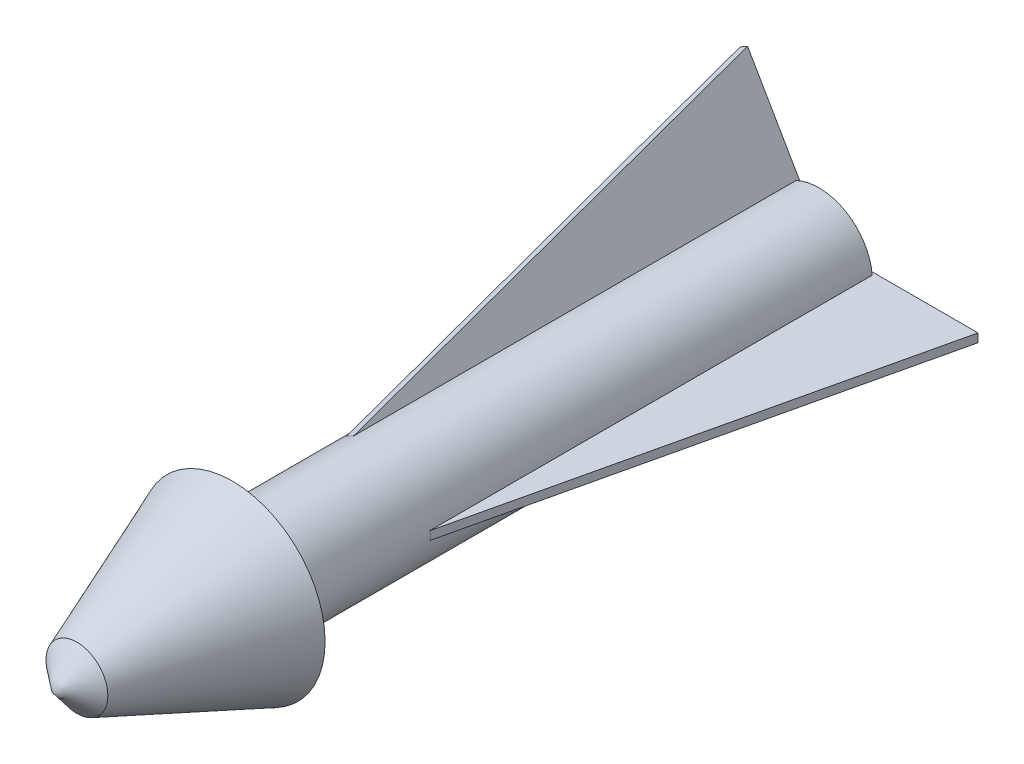
ISO-10303-21;
HEADER;
FILE_DESCRIPTION(('STEP AP214'),'2;1');
FILE_NAME('part.step','',(''),(''),'','','');
FILE_SCHEMA(('AUTOMOTIVE_DESIGN { 1 0 10303 214 1 1 1 1 }'));
ENDSEC;
DATA;
#1=APPLICATION_CONTEXT('core data for automotive mechanical design processes');
#2=APPLICATION_PROTOCOL_DEFINITION('international standard','automotive_design',2000,#1);
#3=PRODUCT_CONTEXT('',#1,'mechanical');
#4=PRODUCT('Part','Part','',(#3));
#5=PRODUCT_RELATED_PRODUCT_CATEGORY('part','',(#4));
#6=PRODUCT_DEFINITION_FORMATION('','',#4);
#7=PRODUCT_DEFINITION_CONTEXT('part definition',#1,'design');
#8=PRODUCT_DEFINITION('design','',#6,#7);
#9=PRODUCT_DEFINITION_SHAPE('','',#8);
#10=(LENGTH_UNIT() NAMED_UNIT(*) SI_UNIT(.MILLI.,.METRE.));
#11=(NAMED_UNIT(*) PLANE_ANGLE_UNIT() SI_UNIT($,.RADIAN.));
#12=(NAMED_UNIT(*) SI_UNIT($,.STERADIAN.) SOLID_ANGLE_UNIT());
#13=UNCERTAINTY_MEASURE_WITH_UNIT(LENGTH_MEASURE(1.E-05),#10,'distance_accuracy_value','');
#14=(GEOMETRIC_REPRESENTATION_CONTEXT(3) GLOBAL_UNCERTAINTY_ASSIGNED_CONTEXT((#13)) GLOBAL_UNIT_ASSIGNED_CONTEXT((#10,
#11,#12)) REPRESENTATION_CONTEXT('',''));
#15=CARTESIAN_POINT('',(0.,0.,0.));
#16=DIRECTION('',(0.,0.,1.));
#17=DIRECTION('',(1.,0.,0.));
#18=AXIS2_PLACEMENT_3D('',#15,#16,#17);
#19=CARTESIAN_POINT('',(0.,0.,11.9935273165166));
#20=DIRECTION('',(0.,0.,-1.));
#21=DIRECTION('',(-1.,0.,0.));
#22=AXIS2_PLACEMENT_3D('',#19,#20,#21);
#23=CONICAL_SURFACE('',#22,10.8765960729396,0.378160492061769);
#24=CARTESIAN_POINT('',(0.,0.,30.2386429629564));
#25=DIRECTION('',(0.,0.,1.));
#26=DIRECTION('',(1.,0.,0.));
#27=AXIS2_PLACEMENT_3D('',#24,#25,#26);
#28=CIRCLE('',#27,3.62815245560455);
#29=CARTESIAN_POINT('',(3.62815245560455,0.,30.2386429629564));
#30=VERTEX_POINT('',#29);
#31=EDGE_CURVE('E231',#30,#30,#28,.T.);
#32=ORIENTED_EDGE('',*,*,#31,.F.);
#33=EDGE_LOOP('',(#32));
#34=FACE_BOUND('',#33,.T.);
#35=CARTESIAN_POINT('',(0.,0.,11.9935273165166));
#36=DIRECTION('',(0.,0.,1.));
#37=DIRECTION('',(1.,0.,0.));
#38=AXIS2_PLACEMENT_3D('',#35,#36,#37);
#39=CIRCLE('',#38,10.8765960729396);
#40=CARTESIAN_POINT('',(10.8765960729396,0.,11.9935273165166));
#41=VERTEX_POINT('',#40);
#42=EDGE_CURVE('E244',#41,#41,#39,.T.);
#43=ORIENTED_EDGE('',*,*,#42,.T.);
#44=EDGE_LOOP('',(#43));
#45=FACE_BOUND('',#44,.T.);
#46=ADVANCED_FACE('F37',(#34,#45),#23,.T.);
#47=CARTESIAN_POINT('',(0.,6.26680222571906,11.9935273165166));
#48=DIRECTION('',(0.,0.,1.));
#49=DIRECTION('',(1.,0.,0.));
#50=AXIS2_PLACEMENT_3D('',#47,#48,#49);
#51=PLANE('',#50);
#52=CARTESIAN_POINT('',(0.,0.,11.9935273165166));
#53=DIRECTION('',(0.,0.,1.));
#54=DIRECTION('',(1.,0.,0.));
#55=AXIS2_PLACEMENT_3D('',#52,#53,#54);
#56=CIRCLE('',#55,9.26680222571906);
#57=CARTESIAN_POINT('',(9.26680222571906,0.,11.9935273165166));
#58=VERTEX_POINT('',#57);
#59=EDGE_CURVE('E248',#58,#58,#56,.T.);
#60=ORIENTED_EDGE('',*,*,#59,.T.);
#61=EDGE_LOOP('',(#60));
#62=FACE_BOUND('',#61,.T.);
#63=ORIENTED_EDGE('',*,*,#42,.F.);
#64=EDGE_LOOP('',(#63));
#65=FACE_BOUND('',#64,.T.);
#66=ADVANCED_FACE('F340',(#62,#65),#51,.F.);
#67=CARTESIAN_POINT('',(0.,0.,44.6785167901676));
#68=DIRECTION('',(0.,0.,1.));
#69=DIRECTION('',(1.,0.,0.));
#70=AXIS2_PLACEMENT_3D('',#67,#68,#69);
#71=CYLINDRICAL_SURFACE('',#70,6.26680222571906);
#72=CARTESIAN_POINT('',(0.,0.,8.99352731651661));
#73=DIRECTION('',(0.,0.,1.));
#74=DIRECTION('',(1.,0.,0.));
#75=AXIS2_PLACEMENT_3D('',#72,#73,#74);
#76=CIRCLE('',#75,6.26680222571906);
#77=CARTESIAN_POINT('',(6.26680222571906,0.,8.99352731651661));
#78=VERTEX_POINT('',#77);
#79=EDGE_CURVE('E251',#78,#78,#76,.F.);
#80=ORIENTED_EDGE('',*,*,#79,.T.);
#81=EDGE_LOOP('',(#80));
#82=FACE_BOUND('',#81,.T.);
#83=CARTESIAN_POINT('',(0.,0.,22.1517486672609));
#84=DIRECTION('',(0.487185032392611,0.843829228791109,-0.224951054343858));
#85=DIRECTION('',(0.112475527171927,0.194813327669876,0.974370064785237));
#86=AXIS2_PLACEMENT_3D('',#83,#84,#85);
#87=ELLIPSE('',#86,27.8585145733066,6.26680222571906);
#88=CARTESIAN_POINT('',(-2.69039930008079,-5.65990828038778,-4.90621879673166));
#89=VERTEX_POINT('',#88);
#90=CARTESIAN_POINT('',(-3.55642470386523,-5.15990828038779,-4.9062187967316));
#91=VERTEX_POINT('',#90);
#92=EDGE_CURVE('E11',#89,#91,#87,.T.);
#93=ORIENTED_EDGE('',*,*,#92,.F.);
#94=DIRECTION('',(0.,0.,1.));
#95=VECTOR('',#94,1.);
#96=CARTESIAN_POINT('',(-2.69039930008079,-5.65990828038778,44.6785167901676));
#97=LINE('',#96,#95);
#98=CARTESIAN_POINT('',(-2.69039930008079,-5.65990828038779,-56.8355676073596));
#99=VERTEX_POINT('',#98);
#100=EDGE_CURVE('E171',#89,#99,#97,.F.);
#101=ORIENTED_EDGE('',*,*,#100,.T.);
#102=CARTESIAN_POINT('',(0.,0.,-56.8355676073596));
#103=DIRECTION('',(0.,0.,1.));
#104=DIRECTION('',(1.,0.,0.));
#105=AXIS2_PLACEMENT_3D('',#102,#103,#104);
#106=CIRCLE('',#105,6.26680222571906);
#107=CARTESIAN_POINT('',(6.24682400394612,-0.5,-56.8355676073596));
#108=VERTEX_POINT('',#107);
#109=EDGE_CURVE('E240',#99,#108,#106,.T.);
#110=ORIENTED_EDGE('',*,*,#109,.T.);
#111=DIRECTION('',(0.,0.,1.));
#112=VECTOR('',#111,1.);
#113=CARTESIAN_POINT('',(6.24682400394611,-0.5,44.6785167901676));
#114=LINE('',#113,#112);
#115=CARTESIAN_POINT('',(6.24682400394611,-0.5,-4.9062187967316));
#116=VERTEX_POINT('',#115);
#117=EDGE_CURVE('E226',#116,#108,#114,.F.);
#118=ORIENTED_EDGE('',*,*,#117,.F.);
#119=CARTESIAN_POINT('',(0.,0.,22.1517486672609));
#120=DIRECTION('',(-0.974370064785237,0.,-0.224951054343858));
#121=DIRECTION('',(-0.224951054343858,0.,0.974370064785237));
#122=AXIS2_PLACEMENT_3D('',#119,#120,#121);
#123=ELLIPSE('',#122,27.8585145733066,6.26680222571906);
#124=CARTESIAN_POINT('',(6.24682400394612,0.5,-4.90621879673165));
#125=VERTEX_POINT('',#124);
#126=EDGE_CURVE('E262',#125,#116,#123,.T.);
#127=ORIENTED_EDGE('',*,*,#126,.F.);
#128=DIRECTION('',(0.,0.,1.));
#129=VECTOR('',#128,1.);
#130=CARTESIAN_POINT('',(6.24682400394611,0.5,44.6785167901676));
#131=LINE('',#130,#129);
#132=CARTESIAN_POINT('',(6.24682400394612,0.5,-56.8355676073596));
#133=VERTEX_POINT('',#132);
#134=EDGE_CURVE('E229',#125,#133,#131,.F.);
#135=ORIENTED_EDGE('',*,*,#134,.T.);
#136=CARTESIAN_POINT('',(-2.69039930008087,5.65990828038775,-56.8355676073596));
#137=VERTEX_POINT('',#136);
#138=EDGE_CURVE('E241',#133,#137,#106,.T.);
#139=ORIENTED_EDGE('',*,*,#138,.T.);
#140=DIRECTION('',(0.,0.,1.));
#141=VECTOR('',#140,1.);
#142=CARTESIAN_POINT('',(-2.69039930008086,5.65990828038775,44.6785167901676));
#143=LINE('',#142,#141);
#144=CARTESIAN_POINT('',(-2.69039930008086,5.65990828038774,-4.9062187967316));
#145=VERTEX_POINT('',#144);
#146=EDGE_CURVE('E199',#145,#137,#143,.F.);
#147=ORIENTED_EDGE('',*,*,#146,.F.);
#148=CARTESIAN_POINT('',(0.,0.,22.1517486672609));
#149=DIRECTION('',(0.487185032392622,-0.843829228791102,-0.224951054343858));
#150=DIRECTION('',(0.11247552717193,-0.194813327669875,0.974370064785237));
#151=AXIS2_PLACEMENT_3D('',#148,#149,#150);
#152=ELLIPSE('',#151,27.8585145733066,6.26680222571906);
#153=CARTESIAN_POINT('',(-3.5564247038653,5.15990828038774,-4.90621879673165));
#154=VERTEX_POINT('',#153);
#155=EDGE_CURVE('E273',#154,#145,#152,.T.);
#156=ORIENTED_EDGE('',*,*,#155,.F.);
#157=DIRECTION('',(0.,0.,1.));
#158=VECTOR('',#157,1.);
#159=CARTESIAN_POINT('',(-3.5564247038653,5.15990828038774,44.6785167901676));
#160=LINE('',#159,#158);
#161=CARTESIAN_POINT('',(-3.5564247038653,5.15990828038774,-56.8355676073596));
#162=VERTEX_POINT('',#161);
#163=EDGE_CURVE('E202',#154,#162,#160,.F.);
#164=ORIENTED_EDGE('',*,*,#163,.T.);
#165=CARTESIAN_POINT('',(-3.55642470386523,-5.1599082803878,-56.8355676073596));
#166=VERTEX_POINT('',#165);
#167=EDGE_CURVE('E245',#162,#166,#106,.T.);
#168=ORIENTED_EDGE('',*,*,#167,.T.);
#169=DIRECTION('',(0.,0.,1.));
#170=VECTOR('',#169,1.);
#171=CARTESIAN_POINT('',(-3.55642470386523,-5.15990828038779,44.6785167901676));
#172=LINE('',#171,#170);
#173=EDGE_CURVE('E55',#91,#166,#172,.F.);
#174=ORIENTED_EDGE('',*,*,#173,.F.);
#175=EDGE_LOOP('',(#93,#101,#110,#118,#127,#135,#139,#147,#156,#164,#168,#174));
#176=FACE_BOUND('',#175,.T.);
#177=ADVANCED_FACE('F295',(#82,#176),#71,.T.);
#178=CARTESIAN_POINT('',(0.,4.93302839592502,-56.8355676073596));
#179=DIRECTION('',(0.,0.,1.));
#180=DIRECTION('',(1.,0.,0.));
#181=AXIS2_PLACEMENT_3D('',#178,#179,#180);
#182=PLANE('',#181);
#183=ORIENTED_EDGE('',*,*,#109,.F.);
#184=DIRECTION('',(0.499999999999992,0.866025403784443,0.));
#185=VECTOR('',#184,1.);
#186=CARTESIAN_POINT('',(2.56907665612273,3.44977129694381,-56.8355676073596));
#187=LINE('',#186,#185);
#188=CARTESIAN_POINT('',(-2.35458275123341,-5.07825695576168,-56.8355676073596));
#189=VERTEX_POINT('',#188);
#190=EDGE_CURVE('E45',#99,#189,#187,.T.);
#191=ORIENTED_EDGE('',*,*,#190,.T.);
#192=DIRECTION('',(0.866025403784443,-0.499999999999992,0.));
#193=VECTOR('',#192,1.);
#194=CARTESIAN_POINT('',(-4.92365940735614,-3.59499985678047,-56.8355676073596));
#195=LINE('',#194,#193);
#196=CARTESIAN_POINT('',(-3.22060815501785,-4.57825695576168,-56.8355676073596));
#197=VERTEX_POINT('',#196);
#198=EDGE_CURVE('E152',#197,#189,#195,.T.);
#199=ORIENTED_EDGE('',*,*,#198,.F.);
#200=DIRECTION('',(0.499999999999992,0.866025403784443,0.));
#201=VECTOR('',#200,1.);
#202=CARTESIAN_POINT('',(1.70305125233829,3.9497712969438,-56.8355676073596));
#203=LINE('',#202,#201);
#204=EDGE_CURVE('E276',#166,#197,#203,.T.);
#205=ORIENTED_EDGE('',*,*,#204,.F.);
#206=ORIENTED_EDGE('',*,*,#167,.F.);
#207=DIRECTION('',(0.500000000000004,-0.866025403784436,0.));
#208=VECTOR('',#207,1.);
#209=CARTESIAN_POINT('',(-2.56907665612276,3.44977129694374,-56.8355676073596));
#210=LINE('',#209,#208);
#211=CARTESIAN_POINT('',(-3.22060815501792,4.57825695576164,-56.8355676073596));
#212=VERTEX_POINT('',#211);
#213=EDGE_CURVE('E271',#162,#212,#210,.T.);
#214=ORIENTED_EDGE('',*,*,#213,.T.);
#215=DIRECTION('',(-0.866025403784436,-0.500000000000004,0.));
#216=VECTOR('',#215,1.);
#217=CARTESIAN_POINT('',(-0.651531498895152,6.06151405474292,-56.8355676073596));
#218=LINE('',#217,#216);
#219=CARTESIAN_POINT('',(-2.35458275123348,5.07825695576164,-56.8355676073596));
#220=VERTEX_POINT('',#219);
#221=EDGE_CURVE('E268',#220,#212,#218,.T.);
#222=ORIENTED_EDGE('',*,*,#221,.F.);
#223=DIRECTION('',(0.500000000000004,-0.866025403784436,0.));
#224=VECTOR('',#223,1.);
#225=CARTESIAN_POINT('',(-1.70305125233833,3.94977129694375,-56.8355676073596));
#226=LINE('',#225,#224);
#227=EDGE_CURVE('E265',#137,#220,#226,.T.);
#228=ORIENTED_EDGE('',*,*,#227,.F.);
#229=ORIENTED_EDGE('',*,*,#138,.F.);
#230=DIRECTION('',(-1.,0.,0.));
#231=VECTOR('',#230,1.);
#232=CARTESIAN_POINT('',(0.,0.5,-56.8355676073596));
#233=LINE('',#232,#231);
#234=CARTESIAN_POINT('',(5.57519090625135,0.5,-56.8355676073596));
#235=VERTEX_POINT('',#234);
#236=EDGE_CURVE('E260',#133,#235,#233,.T.);
#237=ORIENTED_EDGE('',*,*,#236,.T.);
#238=DIRECTION('',(0.,1.,0.));
#239=VECTOR('',#238,1.);
#240=CARTESIAN_POINT('',(5.57519090625135,4.93302839592502,-56.8355676073596));
#241=LINE('',#240,#239);
#242=CARTESIAN_POINT('',(5.57519090625135,-0.5,-56.8355676073596));
#243=VERTEX_POINT('',#242);
#244=EDGE_CURVE('E257',#243,#235,#241,.T.);
#245=ORIENTED_EDGE('',*,*,#244,.F.);
#246=DIRECTION('',(-1.,0.,0.));
#247=VECTOR('',#246,1.);
#248=CARTESIAN_POINT('',(0.,-0.5,-56.8355676073596));
#249=LINE('',#248,#247);
#250=EDGE_CURVE('E254',#108,#243,#249,.T.);
#251=ORIENTED_EDGE('',*,*,#250,.F.);
#252=EDGE_LOOP('',(#183,#191,#199,#205,#206,#214,#222,#228,#229,#237,#245,#251));
#253=FACE_BOUND('',#252,.T.);
#254=CARTESIAN_POINT('',(0.,0.,-56.8355676073596));
#255=DIRECTION('',(0.,0.,1.));
#256=DIRECTION('',(1.,0.,0.));
#257=AXIS2_PLACEMENT_3D('',#254,#255,#256);
#258=CIRCLE('',#257,4.93302839592502);
#259=CARTESIAN_POINT('',(4.93302839592502,0.,-56.8355676073596));
#260=VERTEX_POINT('',#259);
#261=EDGE_CURVE('E237',#260,#260,#258,.T.);
#262=ORIENTED_EDGE('',*,*,#261,.T.);
#263=EDGE_LOOP('',(#262));
#264=FACE_BOUND('',#263,.T.);
#265=ADVANCED_FACE('F281',(#253,#264),#182,.F.);
#266=CARTESIAN_POINT('',(0.,0.,44.6785167901676));
#267=DIRECTION('',(0.,0.,1.));
#268=DIRECTION('',(1.,0.,0.));
#269=AXIS2_PLACEMENT_3D('',#266,#267,#268);
#270=CYLINDRICAL_SURFACE('',#269,4.93302839592502);
#271=ORIENTED_EDGE('',*,*,#261,.F.);
#272=EDGE_LOOP('',(#271));
#273=FACE_BOUND('',#272,.T.);
#274=CARTESIAN_POINT('',(0.,0.,-6.83556760735957));
#275=DIRECTION('',(0.,0.,1.));
#276=DIRECTION('',(1.,0.,0.));
#277=AXIS2_PLACEMENT_3D('',#274,#275,#276);
#278=CIRCLE('',#277,4.93302839592502);
#279=CARTESIAN_POINT('',(4.93302839592502,0.,-6.83556760735957));
#280=VERTEX_POINT('',#279);
#281=EDGE_CURVE('E234',#280,#280,#278,.T.);
#282=ORIENTED_EDGE('',*,*,#281,.T.);
#283=EDGE_LOOP('',(#282));
#284=FACE_BOUND('',#283,.T.);
#285=ADVANCED_FACE('F355',(#273,#284),#270,.F.);
#286=CARTESIAN_POINT('',(0.,0.,-6.83556760735957));
#287=DIRECTION('',(0.,0.,1.));
#288=DIRECTION('',(1.,0.,0.));
#289=AXIS2_PLACEMENT_3D('',#286,#287,#288);
#290=PLANE('',#289);
#291=ORIENTED_EDGE('',*,*,#281,.F.);
#292=EDGE_LOOP('',(#291));
#293=FACE_BOUND('',#292,.T.);
#294=ADVANCED_FACE('F358',(#293),#290,.F.);
#295=CARTESIAN_POINT('',(0.,0.,30.2386429629564));
#296=DIRECTION('',(0.,0.,-1.));
#297=DIRECTION('',(-1.,0.,0.));
#298=AXIS2_PLACEMENT_3D('',#295,#296,#297);
#299=CONICAL_SURFACE('',#298,3.62815245560455,0.892157212456675);
#300=CARTESIAN_POINT('',(0.,0.,33.1644323926404));
#301=VERTEX_POINT('',#300);
#302=VERTEX_LOOP('',#301);
#303=FACE_BOUND('',#302,.T.);
#304=ORIENTED_EDGE('',*,*,#31,.T.);
#305=EDGE_LOOP('',(#304));
#306=FACE_BOUND('',#305,.T.);
#307=ADVANCED_FACE('F362',(#303,#306),#299,.T.);
#308=CARTESIAN_POINT('',(0.,0.,8.99352731651661));
#309=DIRECTION('',(0.,0.,1.));
#310=DIRECTION('',(1.,0.,0.));
#311=AXIS2_PLACEMENT_3D('',#308,#309,#310);
#312=TOROIDAL_SURFACE('',#311,9.26680222571906,3.);
#313=ORIENTED_EDGE('',*,*,#79,.F.);
#314=EDGE_LOOP('',(#313));
#315=FACE_BOUND('',#314,.T.);
#316=ORIENTED_EDGE('',*,*,#59,.F.);
#317=EDGE_LOOP('',(#316));
#318=FACE_BOUND('',#317,.T.);
#319=ADVANCED_FACE('F39',(#315,#318),#312,.F.);
#320=CARTESIAN_POINT('',(5.57519090625135,0.5,-57.1819875639024));
#321=DIRECTION('',(1.,0.,0.));
#322=DIRECTION('',(0.,0.,-1.));
#323=AXIS2_PLACEMENT_3D('',#320,#321,#322);
#324=PLANE('',#323);
#325=DIRECTION('',(0.,0.,1.));
#326=VECTOR('',#325,1.);
#327=CARTESIAN_POINT('',(5.57519090625135,-0.5,-57.1819875639024));
#328=LINE('',#327,#326);
#329=CARTESIAN_POINT('',(5.57519090625135,-0.5,-57.1819875639024));
#330=VERTEX_POINT('',#329);
#331=EDGE_CURVE('E217',#330,#243,#328,.T.);
#332=ORIENTED_EDGE('',*,*,#331,.T.);
#333=ORIENTED_EDGE('',*,*,#244,.T.);
#334=DIRECTION('',(0.,0.,1.));
#335=VECTOR('',#334,1.);
#336=CARTESIAN_POINT('',(5.57519090625135,0.5,-57.1819875639024));
#337=LINE('',#336,#335);
#338=CARTESIAN_POINT('',(5.57519090625135,0.5,-57.1819875639024));
#339=VERTEX_POINT('',#338);
#340=EDGE_CURVE('E208',#339,#235,#337,.T.);
#341=ORIENTED_EDGE('',*,*,#340,.F.);
#342=DIRECTION('',(0.,-1.,0.));
#343=VECTOR('',#342,1.);
#344=CARTESIAN_POINT('',(5.57519090625135,0.5,-57.1819875639024));
#345=LINE('',#344,#343);
#346=EDGE_CURVE('E223',#339,#330,#345,.T.);
#347=ORIENTED_EDGE('',*,*,#346,.T.);
#348=EDGE_LOOP('',(#332,#333,#341,#347));
#349=FACE_BOUND('',#348,.T.);
#350=ADVANCED_FACE('F369',(#349),#324,.F.);
#351=CARTESIAN_POINT('',(0.,0.5,0.));
#352=DIRECTION('',(0.,1.,0.));
#353=DIRECTION('',(0.,0.,1.));
#354=AXIS2_PLACEMENT_3D('',#351,#352,#353);
#355=PLANE('',#354);
#356=ORIENTED_EDGE('',*,*,#134,.F.);
#357=DIRECTION('',(0.224951054343858,0.,-0.974370064785237));
#358=VECTOR('',#357,1.);
#359=CARTESIAN_POINT('',(5.57519090625136,0.5,-1.99705623769598));
#360=LINE('',#359,#358);
#361=CARTESIAN_POINT('',(18.3156361789207,0.5,-57.1819875639024));
#362=VERTEX_POINT('',#361);
#363=EDGE_CURVE('E212',#125,#362,#360,.T.);
#364=ORIENTED_EDGE('',*,*,#363,.T.);
#365=DIRECTION('',(-1.,0.,0.));
#366=VECTOR('',#365,1.);
#367=CARTESIAN_POINT('',(18.3156361789207,0.5,-57.1819875639024));
#368=LINE('',#367,#366);
#369=EDGE_CURVE('E205',#362,#339,#368,.T.);
#370=ORIENTED_EDGE('',*,*,#369,.T.);
#371=ORIENTED_EDGE('',*,*,#340,.T.);
#372=ORIENTED_EDGE('',*,*,#236,.F.);
#373=EDGE_LOOP('',(#356,#364,#370,#371,#372));
#374=FACE_BOUND('',#373,.T.);
#375=ADVANCED_FACE('F311',(#374),#355,.T.);
#376=CARTESIAN_POINT('',(0.,-0.5,0.));
#377=DIRECTION('',(0.,1.,0.));
#378=DIRECTION('',(0.,0.,1.));
#379=AXIS2_PLACEMENT_3D('',#376,#377,#378);
#380=PLANE('',#379);
#381=DIRECTION('',(0.224951054343858,0.,-0.974370064785237));
#382=VECTOR('',#381,1.);
#383=CARTESIAN_POINT('',(5.57519090625136,-0.5,-1.99705623769598));
#384=LINE('',#383,#382);
#385=CARTESIAN_POINT('',(18.3156361789207,-0.5,-57.1819875639024));
#386=VERTEX_POINT('',#385);
#387=EDGE_CURVE('E209',#116,#386,#384,.T.);
#388=ORIENTED_EDGE('',*,*,#387,.F.);
#389=ORIENTED_EDGE('',*,*,#117,.T.);
#390=ORIENTED_EDGE('',*,*,#250,.T.);
#391=ORIENTED_EDGE('',*,*,#331,.F.);
#392=DIRECTION('',(-1.,0.,0.));
#393=VECTOR('',#392,1.);
#394=CARTESIAN_POINT('',(18.3156361789207,-0.5,-57.1819875639024));
#395=LINE('',#394,#393);
#396=EDGE_CURVE('E204',#386,#330,#395,.T.);
#397=ORIENTED_EDGE('',*,*,#396,.F.);
#398=EDGE_LOOP('',(#388,#389,#390,#391,#397));
#399=FACE_BOUND('',#398,.T.);
#400=ADVANCED_FACE('F299',(#399),#380,.F.);
#401=CARTESIAN_POINT('',(18.3156361789207,0.5,-57.1819875639024));
#402=DIRECTION('',(0.,0.,1.));
#403=DIRECTION('',(1.,0.,0.));
#404=AXIS2_PLACEMENT_3D('',#401,#402,#403);
#405=PLANE('',#404);
#406=ORIENTED_EDGE('',*,*,#396,.T.);
#407=ORIENTED_EDGE('',*,*,#346,.F.);
#408=ORIENTED_EDGE('',*,*,#369,.F.);
#409=DIRECTION('',(0.,-1.,0.));
#410=VECTOR('',#409,1.);
#411=CARTESIAN_POINT('',(18.3156361789207,0.5,-57.1819875639024));
#412=LINE('',#411,#410);
#413=EDGE_CURVE('E214',#362,#386,#412,.T.);
#414=ORIENTED_EDGE('',*,*,#413,.T.);
#415=EDGE_LOOP('',(#406,#407,#408,#414));
#416=FACE_BOUND('',#415,.T.);
#417=ADVANCED_FACE('F307',(#416),#405,.F.);
#418=CARTESIAN_POINT('',(5.57519090625136,0.5,-1.99705623769598));
#419=DIRECTION('',(-0.974370064785237,0.,-0.224951054343858));
#420=DIRECTION('',(-0.224951054343858,0.,0.974370064785237));
#421=AXIS2_PLACEMENT_3D('',#418,#419,#420);
#422=PLANE('',#421);
#423=ORIENTED_EDGE('',*,*,#363,.F.);
#424=ORIENTED_EDGE('',*,*,#126,.T.);
#425=ORIENTED_EDGE('',*,*,#387,.T.);
#426=ORIENTED_EDGE('',*,*,#413,.F.);
#427=EDGE_LOOP('',(#423,#424,#425,#426));
#428=FACE_BOUND('',#427,.T.);
#429=ADVANCED_FACE('F304',(#428),#422,.F.);
#430=CARTESIAN_POINT('',(-3.22060815501792,4.57825695576164,-57.1819875639024));
#431=DIRECTION('',(-0.500000000000004,0.866025403784436,0.));
#432=DIRECTION('',(-0.866025403784436,-0.500000000000004,0.));
#433=AXIS2_PLACEMENT_3D('',#430,#431,#432);
#434=PLANE('',#433);
#435=DIRECTION('',(0.,0.,1.));
#436=VECTOR('',#435,1.);
#437=CARTESIAN_POINT('',(-2.35458275123348,5.07825695576164,-57.1819875639024));
#438=LINE('',#437,#436);
#439=CARTESIAN_POINT('',(-2.35458275123348,5.07825695576164,-57.1819875639024));
#440=VERTEX_POINT('',#439);
#441=EDGE_CURVE('E190',#440,#220,#438,.T.);
#442=ORIENTED_EDGE('',*,*,#441,.T.);
#443=ORIENTED_EDGE('',*,*,#221,.T.);
#444=DIRECTION('',(0.,0.,1.));
#445=VECTOR('',#444,1.);
#446=CARTESIAN_POINT('',(-3.22060815501792,4.57825695576164,-57.1819875639024));
#447=LINE('',#446,#445);
#448=CARTESIAN_POINT('',(-3.22060815501792,4.57825695576164,-57.1819875639024));
#449=VERTEX_POINT('',#448);
#450=EDGE_CURVE('E181',#449,#212,#447,.T.);
#451=ORIENTED_EDGE('',*,*,#450,.F.);
#452=DIRECTION('',(0.866025403784436,0.500000000000004,0.));
#453=VECTOR('',#452,1.);
#454=CARTESIAN_POINT('',(-3.22060815501792,4.57825695576164,-57.1819875639024));
#455=LINE('',#454,#453);
#456=EDGE_CURVE('E196',#449,#440,#455,.T.);
#457=ORIENTED_EDGE('',*,*,#456,.T.);
#458=EDGE_LOOP('',(#442,#443,#451,#457));
#459=FACE_BOUND('',#458,.T.);
#460=ADVANCED_FACE('F319',(#459),#434,.F.);
#461=CARTESIAN_POINT('',(-0.433012701892218,-0.250000000000002,0.));
#462=DIRECTION('',(-0.866025403784436,-0.500000000000004,0.));
#463=DIRECTION('',(0.,0.,1.));
#464=AXIS2_PLACEMENT_3D('',#461,#462,#463);
#465=PLANE('',#464);
#466=ORIENTED_EDGE('',*,*,#163,.F.);
#467=DIRECTION('',(-0.11247552717193,0.194813327669875,-0.974370064785237));
#468=VECTOR('',#467,1.);
#469=CARTESIAN_POINT('',(-3.22060815501792,4.57825695576165,-1.99705623769598));
#470=LINE('',#469,#468);
#471=CARTESIAN_POINT('',(-9.59083079135262,15.6118062174186,-57.1819875639024));
#472=VERTEX_POINT('',#471);
#473=EDGE_CURVE('E185',#154,#472,#470,.T.);
#474=ORIENTED_EDGE('',*,*,#473,.T.);
#475=DIRECTION('',(0.500000000000004,-0.866025403784436,0.));
#476=VECTOR('',#475,1.);
#477=CARTESIAN_POINT('',(-9.59083079135262,15.6118062174186,-57.1819875639024));
#478=LINE('',#477,#476);
#479=EDGE_CURVE('E178',#472,#449,#478,.T.);
#480=ORIENTED_EDGE('',*,*,#479,.T.);
#481=ORIENTED_EDGE('',*,*,#450,.T.);
#482=ORIENTED_EDGE('',*,*,#213,.F.);
#483=EDGE_LOOP('',(#466,#474,#480,#481,#482));
#484=FACE_BOUND('',#483,.T.);
#485=ADVANCED_FACE('F329',(#484),#465,.T.);
#486=CARTESIAN_POINT('',(0.433012701892218,0.250000000000002,0.));
#487=DIRECTION('',(-0.866025403784436,-0.500000000000004,0.));
#488=DIRECTION('',(0.,0.,1.));
#489=AXIS2_PLACEMENT_3D('',#486,#487,#488);
#490=PLANE('',#489);
#491=DIRECTION('',(-0.11247552717193,0.194813327669875,-0.974370064785237));
#492=VECTOR('',#491,1.);
#493=CARTESIAN_POINT('',(-2.35458275123348,5.07825695576165,-1.99705623769598));
#494=LINE('',#493,#492);
#495=CARTESIAN_POINT('',(-8.72480538756819,16.1118062174186,-57.1819875639024));
#496=VERTEX_POINT('',#495);
#497=EDGE_CURVE('E182',#145,#496,#494,.T.);
#498=ORIENTED_EDGE('',*,*,#497,.F.);
#499=ORIENTED_EDGE('',*,*,#146,.T.);
#500=ORIENTED_EDGE('',*,*,#227,.T.);
#501=ORIENTED_EDGE('',*,*,#441,.F.);
#502=DIRECTION('',(0.500000000000004,-0.866025403784436,0.));
#503=VECTOR('',#502,1.);
#504=CARTESIAN_POINT('',(-8.72480538756819,16.1118062174186,-57.1819875639024));
#505=LINE('',#504,#503);
#506=EDGE_CURVE('E177',#496,#440,#505,.T.);
#507=ORIENTED_EDGE('',*,*,#506,.F.);
#508=EDGE_LOOP('',(#498,#499,#500,#501,#507));
#509=FACE_BOUND('',#508,.T.);
#510=ADVANCED_FACE('F316',(#509),#490,.F.);
#511=CARTESIAN_POINT('',(-9.59083079135262,15.6118062174186,-57.1819875639024));
#512=DIRECTION('',(0.,0.,1.));
#513=DIRECTION('',(1.,0.,0.));
#514=AXIS2_PLACEMENT_3D('',#511,#512,#513);
#515=PLANE('',#514);
#516=ORIENTED_EDGE('',*,*,#506,.T.);
#517=ORIENTED_EDGE('',*,*,#456,.F.);
#518=ORIENTED_EDGE('',*,*,#479,.F.);
#519=DIRECTION('',(0.866025403784436,0.500000000000004,0.));
#520=VECTOR('',#519,1.);
#521=CARTESIAN_POINT('',(-9.59083079135262,15.6118062174186,-57.1819875639024));
#522=LINE('',#521,#520);
#523=EDGE_CURVE('E187',#472,#496,#522,.T.);
#524=ORIENTED_EDGE('',*,*,#523,.T.);
#525=EDGE_LOOP('',(#516,#517,#518,#524));
#526=FACE_BOUND('',#525,.T.);
#527=ADVANCED_FACE('F323',(#526),#515,.F.);
#528=CARTESIAN_POINT('',(-3.22060815501792,4.57825695576165,-1.99705623769598));
#529=DIRECTION('',(0.487185032392622,-0.843829228791102,-0.224951054343858));
#530=DIRECTION('',(0.866025403784436,0.500000000000004,0.));
#531=AXIS2_PLACEMENT_3D('',#528,#529,#530);
#532=PLANE('',#531);
#533=ORIENTED_EDGE('',*,*,#473,.F.);
#534=ORIENTED_EDGE('',*,*,#155,.T.);
#535=ORIENTED_EDGE('',*,*,#497,.T.);
#536=ORIENTED_EDGE('',*,*,#523,.F.);
#537=EDGE_LOOP('',(#533,#534,#535,#536));
#538=FACE_BOUND('',#537,.T.);
#539=ADVANCED_FACE('F327',(#538),#532,.F.);
#540=CARTESIAN_POINT('',(-2.35458275123341,-5.07825695576168,-57.1819875639024));
#541=DIRECTION('',(-0.499999999999992,-0.866025403784443,0.));
#542=DIRECTION('',(0.866025403784443,-0.499999999999992,0.));
#543=AXIS2_PLACEMENT_3D('',#540,#541,#542);
#544=PLANE('',#543);
#545=DIRECTION('',(0.,0.,1.));
#546=VECTOR('',#545,1.);
#547=CARTESIAN_POINT('',(-3.22060815501785,-4.57825695576168,-57.1819875639024));
#548=LINE('',#547,#546);
#549=CARTESIAN_POINT('',(-3.22060815501785,-4.57825695576168,-57.1819875639024));
#550=VERTEX_POINT('',#549);
#551=EDGE_CURVE('E290',#550,#197,#548,.T.);
#552=ORIENTED_EDGE('',*,*,#551,.T.);
#553=ORIENTED_EDGE('',*,*,#198,.T.);
#554=DIRECTION('',(0.,0.,1.));
#555=VECTOR('',#554,1.);
#556=CARTESIAN_POINT('',(-2.35458275123341,-5.07825695576168,-57.1819875639024));
#557=LINE('',#556,#555);
#558=CARTESIAN_POINT('',(-2.35458275123341,-5.07825695576168,-57.1819875639024));
#559=VERTEX_POINT('',#558);
#560=EDGE_CURVE('E145',#559,#189,#557,.T.);
#561=ORIENTED_EDGE('',*,*,#560,.F.);
#562=DIRECTION('',(-0.866025403784443,0.499999999999992,0.));
#563=VECTOR('',#562,1.);
#564=CARTESIAN_POINT('',(-2.35458275123341,-5.07825695576168,-57.1819875639024));
#565=LINE('',#564,#563);
#566=EDGE_CURVE('E150',#559,#550,#565,.T.);
#567=ORIENTED_EDGE('',*,*,#566,.T.);
#568=EDGE_LOOP('',(#552,#553,#561,#567));
#569=FACE_BOUND('',#568,.T.);
#570=ADVANCED_FACE('F148',(#569),#544,.F.);
#571=CARTESIAN_POINT('',(0.433012701892222,-0.249999999999996,0.));
#572=DIRECTION('',(0.866025403784443,-0.499999999999992,0.));
#573=DIRECTION('',(0.,0.,1.));
#574=AXIS2_PLACEMENT_3D('',#571,#572,#573);
#575=PLANE('',#574);
#576=ORIENTED_EDGE('',*,*,#100,.F.);
#577=DIRECTION('',(-0.112475527171927,-0.194813327669876,-0.974370064785237));
#578=VECTOR('',#577,1.);
#579=CARTESIAN_POINT('',(-2.35458275123341,-5.07825695576168,-1.99705623769598));
#580=LINE('',#579,#578);
#581=CARTESIAN_POINT('',(-8.72480538756796,-16.1118062174187,-57.1819875639024));
#582=VERTEX_POINT('',#581);
#583=EDGE_CURVE('E155',#89,#582,#580,.T.);
#584=ORIENTED_EDGE('',*,*,#583,.T.);
#585=DIRECTION('',(0.499999999999992,0.866025403784443,0.));
#586=VECTOR('',#585,1.);
#587=CARTESIAN_POINT('',(-8.72480538756796,-16.1118062174187,-57.1819875639024));
#588=LINE('',#587,#586);
#589=EDGE_CURVE('E156',#582,#559,#588,.T.);
#590=ORIENTED_EDGE('',*,*,#589,.T.);
#591=ORIENTED_EDGE('',*,*,#560,.T.);
#592=ORIENTED_EDGE('',*,*,#190,.F.);
#593=EDGE_LOOP('',(#576,#584,#590,#591,#592));
#594=FACE_BOUND('',#593,.T.);
#595=ADVANCED_FACE('F159',(#594),#575,.T.);
#596=CARTESIAN_POINT('',(-0.433012701892222,0.249999999999996,0.));
#597=DIRECTION('',(0.866025403784443,-0.499999999999992,0.));
#598=DIRECTION('',(0.,0.,1.));
#599=AXIS2_PLACEMENT_3D('',#596,#597,#598);
#600=PLANE('',#599);
#601=DIRECTION('',(-0.112475527171927,-0.194813327669876,-0.974370064785237));
#602=VECTOR('',#601,1.);
#603=CARTESIAN_POINT('',(-3.22060815501785,-4.57825695576169,-1.99705623769598));
#604=LINE('',#603,#602);
#605=CARTESIAN_POINT('',(-9.5908307913524,-15.6118062174187,-57.1819875639024));
#606=VERTEX_POINT('',#605);
#607=EDGE_CURVE('E164',#91,#606,#604,.T.);
#608=ORIENTED_EDGE('',*,*,#607,.F.);
#609=ORIENTED_EDGE('',*,*,#173,.T.);
#610=ORIENTED_EDGE('',*,*,#204,.T.);
#611=ORIENTED_EDGE('',*,*,#551,.F.);
#612=DIRECTION('',(0.499999999999992,0.866025403784443,0.));
#613=VECTOR('',#612,1.);
#614=CARTESIAN_POINT('',(-9.5908307913524,-15.6118062174187,-57.1819875639024));
#615=LINE('',#614,#613);
#616=EDGE_CURVE('E168',#606,#550,#615,.T.);
#617=ORIENTED_EDGE('',*,*,#616,.F.);
#618=EDGE_LOOP('',(#608,#609,#610,#611,#617));
#619=FACE_BOUND('',#618,.T.);
#620=ADVANCED_FACE('F292',(#619),#600,.F.);
#621=CARTESIAN_POINT('',(-8.72480538756796,-16.1118062174187,-57.1819875639024));
#622=DIRECTION('',(0.,0.,1.));
#623=DIRECTION('',(1.,0.,0.));
#624=AXIS2_PLACEMENT_3D('',#621,#622,#623);
#625=PLANE('',#624);
#626=ORIENTED_EDGE('',*,*,#616,.T.);
#627=ORIENTED_EDGE('',*,*,#566,.F.);
#628=ORIENTED_EDGE('',*,*,#589,.F.);
#629=DIRECTION('',(-0.866025403784443,0.499999999999992,0.));
#630=VECTOR('',#629,1.);
#631=CARTESIAN_POINT('',(-8.72480538756796,-16.1118062174187,-57.1819875639024));
#632=LINE('',#631,#630);
#633=EDGE_CURVE('E169',#582,#606,#632,.T.);
#634=ORIENTED_EDGE('',*,*,#633,.T.);
#635=EDGE_LOOP('',(#626,#627,#628,#634));
#636=FACE_BOUND('',#635,.T.);
#637=ADVANCED_FACE('F166',(#636),#625,.F.);
#638=CARTESIAN_POINT('',(-2.35458275123341,-5.07825695576168,-1.99705623769598));
#639=DIRECTION('',(0.487185032392611,0.843829228791109,-0.224951054343858));
#640=DIRECTION('',(-0.866025403784443,0.499999999999992,0.));
#641=AXIS2_PLACEMENT_3D('',#638,#639,#640);
#642=PLANE('',#641);
#643=ORIENTED_EDGE('',*,*,#583,.F.);
#644=ORIENTED_EDGE('',*,*,#92,.T.);
#645=ORIENTED_EDGE('',*,*,#607,.T.);
#646=ORIENTED_EDGE('',*,*,#633,.F.);
#647=EDGE_LOOP('',(#643,#644,#645,#646));
#648=FACE_BOUND('',#647,.T.);
#649=ADVANCED_FACE('F285',(#648),#642,.F.);
#650=CLOSED_SHELL('',(#46,#66,#177,#265,#285,#294,#307,#319,#350,#375,#400,#417,#429,#460,#485,
#510,#527,#539,#570,#595,#620,#637,#649));
#651=MANIFOLD_SOLID_BREP('B2',#650);
#652=ADVANCED_BREP_SHAPE_REPRESENTATION('',(#18,#651),#14);
#653=SHAPE_DEFINITION_REPRESENTATION(#9,#652);
ENDSEC;
END-ISO-10303-21;
